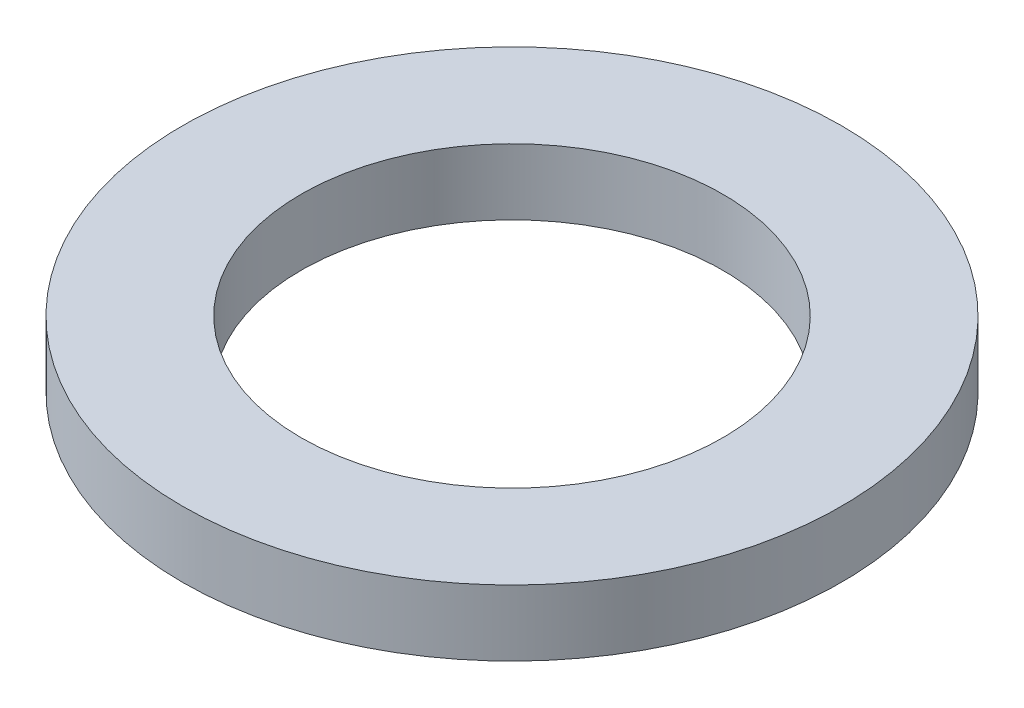
ISO-10303-21;
HEADER;
FILE_DESCRIPTION(('STEP AP214'),'2;1');
FILE_NAME('part.step','',(''),(''),'','','');
FILE_SCHEMA(('AUTOMOTIVE_DESIGN { 1 0 10303 214 1 1 1 1 }'));
ENDSEC;
DATA;
#1=APPLICATION_CONTEXT('core data for automotive mechanical design processes');
#2=APPLICATION_PROTOCOL_DEFINITION('international standard','automotive_design',2000,#1);
#3=PRODUCT_CONTEXT('',#1,'mechanical');
#4=PRODUCT('Part','Part','',(#3));
#5=PRODUCT_RELATED_PRODUCT_CATEGORY('part','',(#4));
#6=PRODUCT_DEFINITION_FORMATION('','',#4);
#7=PRODUCT_DEFINITION_CONTEXT('part definition',#1,'design');
#8=PRODUCT_DEFINITION('design','',#6,#7);
#9=PRODUCT_DEFINITION_SHAPE('','',#8);
#10=(LENGTH_UNIT() NAMED_UNIT(*) SI_UNIT(.MILLI.,.METRE.));
#11=(NAMED_UNIT(*) PLANE_ANGLE_UNIT() SI_UNIT($,.RADIAN.));
#12=(NAMED_UNIT(*) SI_UNIT($,.STERADIAN.) SOLID_ANGLE_UNIT());
#13=UNCERTAINTY_MEASURE_WITH_UNIT(LENGTH_MEASURE(1.E-05),#10,'distance_accuracy_value','');
#14=(GEOMETRIC_REPRESENTATION_CONTEXT(3) GLOBAL_UNCERTAINTY_ASSIGNED_CONTEXT((#13)) GLOBAL_UNIT_ASSIGNED_CONTEXT((#10,
#11,#12)) REPRESENTATION_CONTEXT('',''));
#15=CARTESIAN_POINT('',(0.,0.,0.));
#16=DIRECTION('',(0.,0.,1.));
#17=DIRECTION('',(1.,0.,0.));
#18=AXIS2_PLACEMENT_3D('',#15,#16,#17);
#19=CARTESIAN_POINT('',(0.,1.,0.));
#20=DIRECTION('',(0.,1.,0.));
#21=DIRECTION('',(0.,0.,1.));
#22=AXIS2_PLACEMENT_3D('',#19,#20,#21);
#23=PLANE('',#22);
#24=CARTESIAN_POINT('',(0.,1.,0.));
#25=DIRECTION('',(0.,1.,0.));
#26=DIRECTION('',(0.,0.,1.));
#27=AXIS2_PLACEMENT_3D('',#24,#25,#26);
#28=CIRCLE('',#27,5.);
#29=CARTESIAN_POINT('',(0.,1.,5.));
#30=VERTEX_POINT('',#29);
#31=EDGE_CURVE('E10',#30,#30,#28,.T.);
#32=ORIENTED_EDGE('',*,*,#31,.T.);
#33=EDGE_LOOP('',(#32));
#34=FACE_BOUND('',#33,.T.);
#35=CARTESIAN_POINT('',(0.,1.,0.));
#36=DIRECTION('',(0.,1.,0.));
#37=DIRECTION('',(0.,0.,1.));
#38=AXIS2_PLACEMENT_3D('',#35,#36,#37);
#39=CIRCLE('',#38,3.2);
#40=CARTESIAN_POINT('',(0.,1.,3.2));
#41=VERTEX_POINT('',#40);
#42=EDGE_CURVE('E50',#41,#41,#39,.T.);
#43=ORIENTED_EDGE('',*,*,#42,.F.);
#44=EDGE_LOOP('',(#43));
#45=FACE_BOUND('',#44,.T.);
#46=ADVANCED_FACE('F37',(#34,#45),#23,.T.);
#47=CARTESIAN_POINT('',(0.,0.,0.));
#48=DIRECTION('',(0.,1.,0.));
#49=DIRECTION('',(0.,0.,1.));
#50=AXIS2_PLACEMENT_3D('',#47,#48,#49);
#51=PLANE('',#50);
#52=CARTESIAN_POINT('',(0.,0.,0.));
#53=DIRECTION('',(0.,1.,0.));
#54=DIRECTION('',(0.,0.,1.));
#55=AXIS2_PLACEMENT_3D('',#52,#53,#54);
#56=CIRCLE('',#55,5.);
#57=CARTESIAN_POINT('',(0.,0.,5.));
#58=VERTEX_POINT('',#57);
#59=EDGE_CURVE('E41',#58,#58,#56,.T.);
#60=ORIENTED_EDGE('',*,*,#59,.F.);
#61=EDGE_LOOP('',(#60));
#62=FACE_BOUND('',#61,.T.);
#63=CARTESIAN_POINT('',(0.,0.,0.));
#64=DIRECTION('',(0.,1.,0.));
#65=DIRECTION('',(0.,0.,1.));
#66=AXIS2_PLACEMENT_3D('',#63,#64,#65);
#67=CIRCLE('',#66,3.2);
#68=CARTESIAN_POINT('',(0.,0.,3.2));
#69=VERTEX_POINT('',#68);
#70=EDGE_CURVE('E52',#69,#69,#67,.T.);
#71=ORIENTED_EDGE('',*,*,#70,.T.);
#72=EDGE_LOOP('',(#71));
#73=FACE_BOUND('',#72,.T.);
#74=ADVANCED_FACE('F64',(#62,#73),#51,.F.);
#75=CARTESIAN_POINT('',(0.,1.,0.));
#76=DIRECTION('',(0.,-1.,0.));
#77=DIRECTION('',(0.,0.,-1.));
#78=AXIS2_PLACEMENT_3D('',#75,#76,#77);
#79=CYLINDRICAL_SURFACE('',#78,5.);
#80=ORIENTED_EDGE('',*,*,#31,.F.);
#81=EDGE_LOOP('',(#80));
#82=FACE_BOUND('',#81,.T.);
#83=ORIENTED_EDGE('',*,*,#59,.T.);
#84=EDGE_LOOP('',(#83));
#85=FACE_BOUND('',#84,.T.);
#86=ADVANCED_FACE('F39',(#82,#85),#79,.T.);
#87=CARTESIAN_POINT('',(0.,1.,0.));
#88=DIRECTION('',(0.,-1.,0.));
#89=DIRECTION('',(0.,0.,-1.));
#90=AXIS2_PLACEMENT_3D('',#87,#88,#89);
#91=CYLINDRICAL_SURFACE('',#90,3.2);
#92=ORIENTED_EDGE('',*,*,#42,.T.);
#93=EDGE_LOOP('',(#92));
#94=FACE_BOUND('',#93,.T.);
#95=ORIENTED_EDGE('',*,*,#70,.F.);
#96=EDGE_LOOP('',(#95));
#97=FACE_BOUND('',#96,.T.);
#98=ADVANCED_FACE('F60',(#94,#97),#91,.F.);
#99=CLOSED_SHELL('',(#46,#74,#86,#98));
#100=MANIFOLD_SOLID_BREP('B2',#99);
#101=ADVANCED_BREP_SHAPE_REPRESENTATION('',(#18,#100),#14);
#102=SHAPE_DEFINITION_REPRESENTATION(#9,#101);
ENDSEC;
END-ISO-10303-21;
